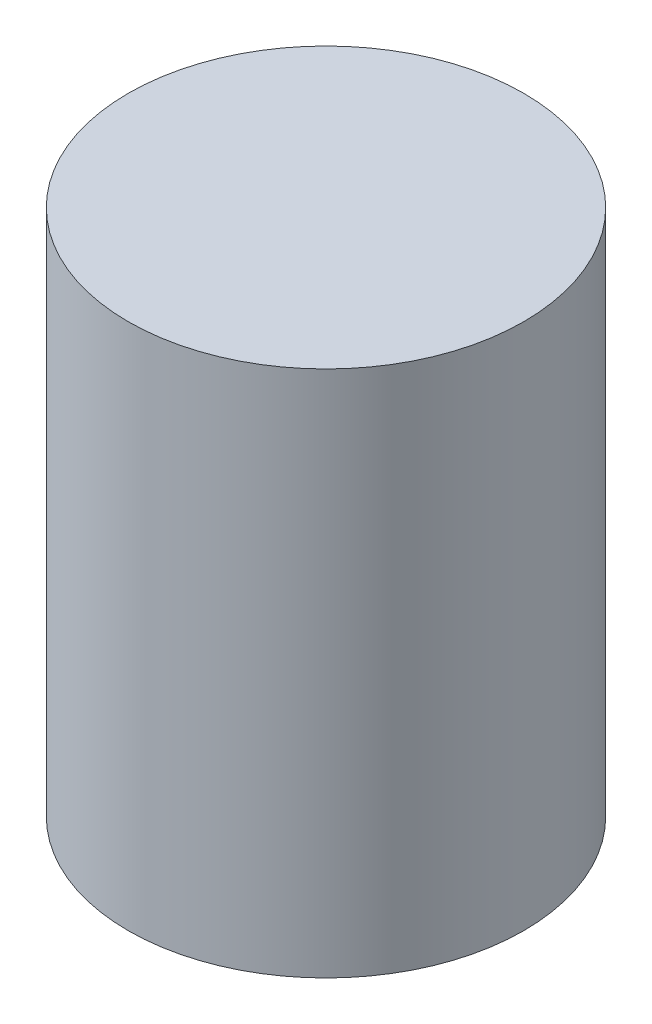
ISO-10303-21;
HEADER;
FILE_DESCRIPTION(('STEP AP214'),'2;1');
FILE_NAME('part.step','',(''),(''),'','','');
FILE_SCHEMA(('AUTOMOTIVE_DESIGN { 1 0 10303 214 1 1 1 1 }'));
ENDSEC;
DATA;
#1=APPLICATION_CONTEXT('core data for automotive mechanical design processes');
#2=APPLICATION_PROTOCOL_DEFINITION('international standard','automotive_design',2000,#1);
#3=PRODUCT_CONTEXT('',#1,'mechanical');
#4=PRODUCT('Part','Part','',(#3));
#5=PRODUCT_RELATED_PRODUCT_CATEGORY('part','',(#4));
#6=PRODUCT_DEFINITION_FORMATION('','',#4);
#7=PRODUCT_DEFINITION_CONTEXT('part definition',#1,'design');
#8=PRODUCT_DEFINITION('design','',#6,#7);
#9=PRODUCT_DEFINITION_SHAPE('','',#8);
#10=(LENGTH_UNIT() NAMED_UNIT(*) SI_UNIT(.MILLI.,.METRE.));
#11=(NAMED_UNIT(*) PLANE_ANGLE_UNIT() SI_UNIT($,.RADIAN.));
#12=(NAMED_UNIT(*) SI_UNIT($,.STERADIAN.) SOLID_ANGLE_UNIT());
#13=UNCERTAINTY_MEASURE_WITH_UNIT(LENGTH_MEASURE(1.E-05),#10,'distance_accuracy_value','');
#14=(GEOMETRIC_REPRESENTATION_CONTEXT(3) GLOBAL_UNCERTAINTY_ASSIGNED_CONTEXT((#13)) GLOBAL_UNIT_ASSIGNED_CONTEXT((#10,
#11,#12)) REPRESENTATION_CONTEXT('',''));
#15=CARTESIAN_POINT('',(0.,0.,0.));
#16=DIRECTION('',(0.,0.,1.));
#17=DIRECTION('',(1.,0.,0.));
#18=AXIS2_PLACEMENT_3D('',#15,#16,#17);
#19=CARTESIAN_POINT('',(0.,0.,0.));
#20=DIRECTION('',(0.,1.,0.));
#21=DIRECTION('',(0.,0.,1.));
#22=AXIS2_PLACEMENT_3D('',#19,#20,#21);
#23=PLANE('',#22);
#24=CARTESIAN_POINT('',(0.,0.,0.));
#25=DIRECTION('',(0.,1.,0.));
#26=DIRECTION('',(0.,0.,1.));
#27=AXIS2_PLACEMENT_3D('',#24,#25,#26);
#28=CIRCLE('',#27,1.5);
#29=CARTESIAN_POINT('',(0.,0.,1.5));
#30=VERTEX_POINT('',#29);
#31=EDGE_CURVE('E54',#30,#30,#28,.T.);
#32=ORIENTED_EDGE('',*,*,#31,.F.);
#33=EDGE_LOOP('',(#32));
#34=FACE_BOUND('',#33,.T.);
#35=ADVANCED_FACE('F47',(#34),#23,.F.);
#36=CARTESIAN_POINT('',(0.,4.,0.));
#37=DIRECTION('',(0.,1.,0.));
#38=DIRECTION('',(0.,0.,1.));
#39=AXIS2_PLACEMENT_3D('',#36,#37,#38);
#40=PLANE('',#39);
#41=CARTESIAN_POINT('',(0.,4.,0.));
#42=DIRECTION('',(0.,1.,0.));
#43=DIRECTION('',(0.,0.,1.));
#44=AXIS2_PLACEMENT_3D('',#41,#42,#43);
#45=CIRCLE('',#44,1.5);
#46=CARTESIAN_POINT('',(0.,4.,1.5));
#47=VERTEX_POINT('',#46);
#48=EDGE_CURVE('E11',#47,#47,#45,.T.);
#49=ORIENTED_EDGE('',*,*,#48,.T.);
#50=EDGE_LOOP('',(#49));
#51=FACE_BOUND('',#50,.T.);
#52=ADVANCED_FACE('F64',(#51),#40,.T.);
#53=CARTESIAN_POINT('',(0.,0.,0.));
#54=DIRECTION('',(0.,1.,0.));
#55=DIRECTION('',(0.,0.,1.));
#56=AXIS2_PLACEMENT_3D('',#53,#54,#55);
#57=CYLINDRICAL_SURFACE('',#56,1.5);
#58=ORIENTED_EDGE('',*,*,#48,.F.);
#59=EDGE_LOOP('',(#58));
#60=FACE_BOUND('',#59,.T.);
#61=ORIENTED_EDGE('',*,*,#31,.T.);
#62=EDGE_LOOP('',(#61));
#63=FACE_BOUND('',#62,.T.);
#64=ADVANCED_FACE('F61',(#60,#63),#57,.T.);
#65=CLOSED_SHELL('',(#35,#52,#64));
#66=MANIFOLD_SOLID_BREP('B2',#65);
#67=ADVANCED_BREP_SHAPE_REPRESENTATION('',(#18,#66),#14);
#68=SHAPE_DEFINITION_REPRESENTATION(#9,#67);
ENDSEC;
END-ISO-10303-21;
